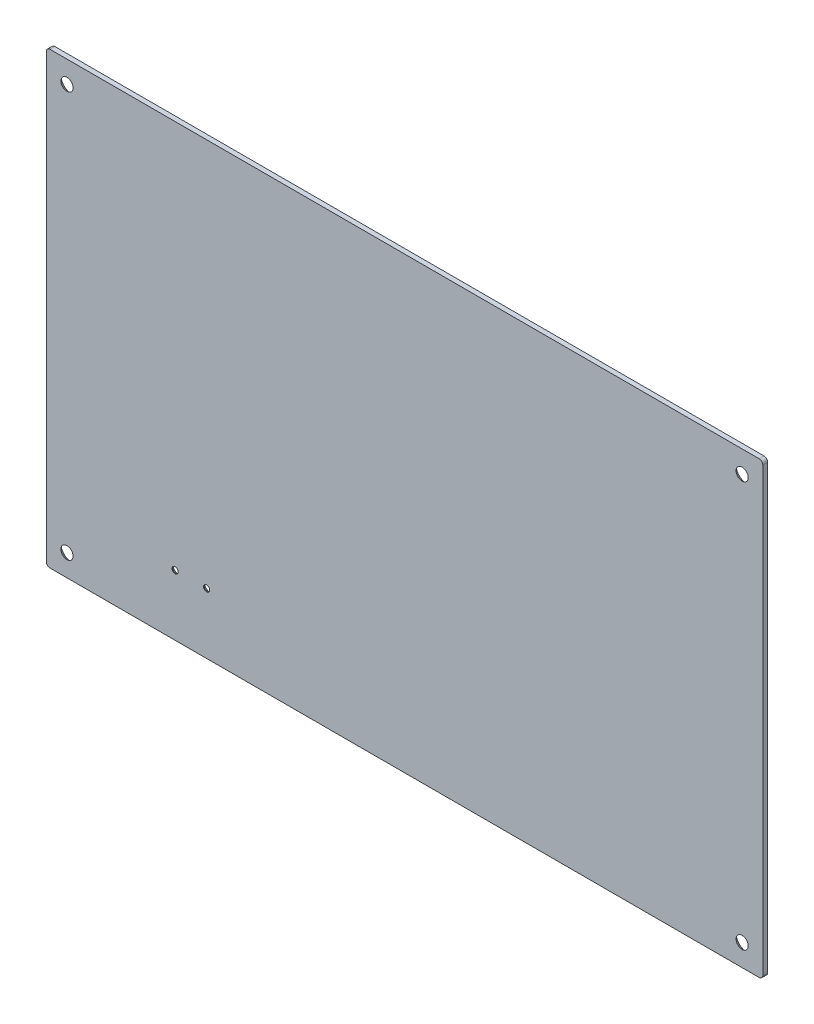
ISO-10303-21;
HEADER;
FILE_DESCRIPTION(('STEP AP214'),'2;1');
FILE_NAME('part.step','',(''),(''),'','','');
FILE_SCHEMA(('AUTOMOTIVE_DESIGN { 1 0 10303 214 1 1 1 1 }'));
ENDSEC;
DATA;
#1=APPLICATION_CONTEXT('core data for automotive mechanical design processes');
#2=APPLICATION_PROTOCOL_DEFINITION('international standard','automotive_design',2000,#1);
#3=PRODUCT_CONTEXT('',#1,'mechanical');
#4=PRODUCT('Part','Part','',(#3));
#5=PRODUCT_RELATED_PRODUCT_CATEGORY('part','',(#4));
#6=PRODUCT_DEFINITION_FORMATION('','',#4);
#7=PRODUCT_DEFINITION_CONTEXT('part definition',#1,'design');
#8=PRODUCT_DEFINITION('design','',#6,#7);
#9=PRODUCT_DEFINITION_SHAPE('','',#8);
#10=(LENGTH_UNIT() NAMED_UNIT(*) SI_UNIT(.MILLI.,.METRE.));
#11=(NAMED_UNIT(*) PLANE_ANGLE_UNIT() SI_UNIT($,.RADIAN.));
#12=(NAMED_UNIT(*) SI_UNIT($,.STERADIAN.) SOLID_ANGLE_UNIT());
#13=UNCERTAINTY_MEASURE_WITH_UNIT(LENGTH_MEASURE(1.E-05),#10,'distance_accuracy_value','');
#14=(GEOMETRIC_REPRESENTATION_CONTEXT(3) GLOBAL_UNCERTAINTY_ASSIGNED_CONTEXT((#13)) GLOBAL_UNIT_ASSIGNED_CONTEXT((#10,
#11,#12)) REPRESENTATION_CONTEXT('',''));
#15=CARTESIAN_POINT('',(0.,0.,0.));
#16=DIRECTION('',(0.,0.,1.));
#17=DIRECTION('',(1.,0.,0.));
#18=AXIS2_PLACEMENT_3D('',#15,#16,#17);
#19=CARTESIAN_POINT('',(146.,-91.,2.));
#20=DIRECTION('',(0.,0.,1.));
#21=DIRECTION('',(1.,0.,0.));
#22=AXIS2_PLACEMENT_3D('',#19,#20,#21);
#23=PLANE('',#22);
#24=CARTESIAN_POINT('',(-94.5000000000001,-67.5,2.));
#25=DIRECTION('',(0.,0.,1.));
#26=DIRECTION('',(1.,0.,0.));
#27=AXIS2_PLACEMENT_3D('',#24,#25,#26);
#28=CIRCLE('',#27,1.24999999999999);
#29=CARTESIAN_POINT('',(-93.2500000000001,-67.5,2.));
#30=VERTEX_POINT('',#29);
#31=EDGE_CURVE('E217',#30,#30,#28,.T.);
#32=ORIENTED_EDGE('',*,*,#31,.F.);
#33=EDGE_LOOP('',(#32));
#34=FACE_BOUND('',#33,.T.);
#35=CARTESIAN_POINT('',(-81.5000000000001,-67.5,2.));
#36=DIRECTION('',(0.,0.,1.));
#37=DIRECTION('',(1.,0.,0.));
#38=AXIS2_PLACEMENT_3D('',#35,#36,#37);
#39=CIRCLE('',#38,1.24999999999999);
#40=CARTESIAN_POINT('',(-80.2500000000001,-67.5,2.));
#41=VERTEX_POINT('',#40);
#42=EDGE_CURVE('E208',#41,#41,#39,.T.);
#43=ORIENTED_EDGE('',*,*,#42,.F.);
#44=EDGE_LOOP('',(#43));
#45=FACE_BOUND('',#44,.T.);
#46=CARTESIAN_POINT('',(139.,-83.5,2.));
#47=DIRECTION('',(0.,0.,1.));
#48=DIRECTION('',(1.,0.,0.));
#49=AXIS2_PLACEMENT_3D('',#46,#47,#48);
#50=CIRCLE('',#49,2.50000000000001);
#51=CARTESIAN_POINT('',(141.5,-83.5,2.));
#52=VERTEX_POINT('',#51);
#53=EDGE_CURVE('E199',#52,#52,#50,.T.);
#54=ORIENTED_EDGE('',*,*,#53,.F.);
#55=EDGE_LOOP('',(#54));
#56=FACE_BOUND('',#55,.T.);
#57=CARTESIAN_POINT('',(-139.,-83.5,2.));
#58=DIRECTION('',(0.,0.,1.));
#59=DIRECTION('',(1.,0.,0.));
#60=AXIS2_PLACEMENT_3D('',#57,#58,#59);
#61=CIRCLE('',#60,2.50000000000001);
#62=CARTESIAN_POINT('',(-136.5,-83.5,2.));
#63=VERTEX_POINT('',#62);
#64=EDGE_CURVE('E187',#63,#63,#61,.T.);
#65=ORIENTED_EDGE('',*,*,#64,.F.);
#66=EDGE_LOOP('',(#65));
#67=FACE_BOUND('',#66,.T.);
#68=CARTESIAN_POINT('',(146.,-91.,2.));
#69=DIRECTION('',(0.,0.,1.));
#70=DIRECTION('',(1.,0.,0.));
#71=AXIS2_PLACEMENT_3D('',#68,#69,#70);
#72=CIRCLE('',#71,1.49999999999999);
#73=CARTESIAN_POINT('',(146.,-92.5,2.));
#74=VERTEX_POINT('',#73);
#75=CARTESIAN_POINT('',(147.5,-91.,2.));
#76=VERTEX_POINT('',#75);
#77=EDGE_CURVE('E149',#74,#76,#72,.T.);
#78=ORIENTED_EDGE('',*,*,#77,.T.);
#79=DIRECTION('',(0.,1.,0.));
#80=VECTOR('',#79,1.);
#81=CARTESIAN_POINT('',(147.5,91.,2.));
#82=LINE('',#81,#80);
#83=CARTESIAN_POINT('',(147.5,91.,2.));
#84=VERTEX_POINT('',#83);
#85=EDGE_CURVE('E97',#76,#84,#82,.T.);
#86=ORIENTED_EDGE('',*,*,#85,.T.);
#87=CARTESIAN_POINT('',(146.,91.,2.));
#88=DIRECTION('',(0.,0.,1.));
#89=DIRECTION('',(-1.,0.,0.));
#90=AXIS2_PLACEMENT_3D('',#87,#88,#89);
#91=CIRCLE('',#90,1.5);
#92=CARTESIAN_POINT('',(146.,92.5,2.));
#93=VERTEX_POINT('',#92);
#94=EDGE_CURVE('E164',#84,#93,#91,.T.);
#95=ORIENTED_EDGE('',*,*,#94,.T.);
#96=DIRECTION('',(-1.,0.,0.));
#97=VECTOR('',#96,1.);
#98=CARTESIAN_POINT('',(-146.,92.5,2.));
#99=LINE('',#98,#97);
#100=CARTESIAN_POINT('',(-146.,92.5,2.));
#101=VERTEX_POINT('',#100);
#102=EDGE_CURVE('E176',#93,#101,#99,.T.);
#103=ORIENTED_EDGE('',*,*,#102,.T.);
#104=CARTESIAN_POINT('',(-146.,91.,2.));
#105=DIRECTION('',(0.,0.,1.));
#106=DIRECTION('',(-1.,0.,0.));
#107=AXIS2_PLACEMENT_3D('',#104,#105,#106);
#108=CIRCLE('',#107,1.5);
#109=CARTESIAN_POINT('',(-147.5,91.,2.));
#110=VERTEX_POINT('',#109);
#111=EDGE_CURVE('E116',#101,#110,#108,.T.);
#112=ORIENTED_EDGE('',*,*,#111,.T.);
#113=DIRECTION('',(0.,-1.,0.));
#114=VECTOR('',#113,1.);
#115=CARTESIAN_POINT('',(-147.5,91.,2.));
#116=LINE('',#115,#114);
#117=CARTESIAN_POINT('',(-147.5,-91.,2.));
#118=VERTEX_POINT('',#117);
#119=EDGE_CURVE('E110',#110,#118,#116,.T.);
#120=ORIENTED_EDGE('',*,*,#119,.T.);
#121=CARTESIAN_POINT('',(-146.,-91.,2.));
#122=DIRECTION('',(0.,0.,1.));
#123=DIRECTION('',(-1.,0.,0.));
#124=AXIS2_PLACEMENT_3D('',#121,#122,#123);
#125=CIRCLE('',#124,1.49999999999999);
#126=CARTESIAN_POINT('',(-146.,-92.5,2.));
#127=VERTEX_POINT('',#126);
#128=EDGE_CURVE('E114',#118,#127,#125,.T.);
#129=ORIENTED_EDGE('',*,*,#128,.T.);
#130=DIRECTION('',(1.,0.,0.));
#131=VECTOR('',#130,1.);
#132=CARTESIAN_POINT('',(-146.,-92.5,2.));
#133=LINE('',#132,#131);
#134=EDGE_CURVE('E54',#127,#74,#133,.T.);
#135=ORIENTED_EDGE('',*,*,#134,.T.);
#136=EDGE_LOOP('',(#78,#86,#95,#103,#112,#120,#129,#135));
#137=FACE_BOUND('',#136,.T.);
#138=CARTESIAN_POINT('',(-139.,83.5,2.));
#139=DIRECTION('',(0.,0.,1.));
#140=DIRECTION('',(1.,0.,0.));
#141=AXIS2_PLACEMENT_3D('',#138,#139,#140);
#142=CIRCLE('',#141,2.50000000000001);
#143=CARTESIAN_POINT('',(-136.5,83.5,2.));
#144=VERTEX_POINT('',#143);
#145=EDGE_CURVE('E138',#144,#144,#142,.T.);
#146=ORIENTED_EDGE('',*,*,#145,.F.);
#147=EDGE_LOOP('',(#146));
#148=FACE_BOUND('',#147,.T.);
#149=CARTESIAN_POINT('',(139.,83.5,2.));
#150=DIRECTION('',(0.,0.,1.));
#151=DIRECTION('',(1.,0.,0.));
#152=AXIS2_PLACEMENT_3D('',#149,#150,#151);
#153=CIRCLE('',#152,2.50000000000001);
#154=CARTESIAN_POINT('',(141.5,83.5,2.));
#155=VERTEX_POINT('',#154);
#156=EDGE_CURVE('E193',#155,#155,#153,.T.);
#157=ORIENTED_EDGE('',*,*,#156,.F.);
#158=EDGE_LOOP('',(#157));
#159=FACE_BOUND('',#158,.T.);
#160=ADVANCED_FACE('F37',(#34,#45,#56,#67,#137,#148,#159),#23,.T.);
#161=CARTESIAN_POINT('',(146.,-91.,2.));
#162=DIRECTION('',(0.,0.,-1.));
#163=DIRECTION('',(-1.,0.,0.));
#164=AXIS2_PLACEMENT_3D('',#161,#162,#163);
#165=CYLINDRICAL_SURFACE('',#164,1.49999999999999);
#166=CARTESIAN_POINT('',(146.,-91.,0.));
#167=DIRECTION('',(0.,0.,1.));
#168=DIRECTION('',(1.,0.,0.));
#169=AXIS2_PLACEMENT_3D('',#166,#167,#168);
#170=CIRCLE('',#169,1.49999999999999);
#171=CARTESIAN_POINT('',(146.,-92.5,0.));
#172=VERTEX_POINT('',#171);
#173=CARTESIAN_POINT('',(147.5,-91.,0.));
#174=VERTEX_POINT('',#173);
#175=EDGE_CURVE('E134',#172,#174,#170,.T.);
#176=ORIENTED_EDGE('',*,*,#175,.T.);
#177=DIRECTION('',(0.,0.,-1.));
#178=VECTOR('',#177,1.);
#179=CARTESIAN_POINT('',(147.5,-91.,2.));
#180=LINE('',#179,#178);
#181=EDGE_CURVE('E11',#76,#174,#180,.T.);
#182=ORIENTED_EDGE('',*,*,#181,.F.);
#183=ORIENTED_EDGE('',*,*,#77,.F.);
#184=DIRECTION('',(0.,0.,-1.));
#185=VECTOR('',#184,1.);
#186=CARTESIAN_POINT('',(146.,-92.5,2.));
#187=LINE('',#186,#185);
#188=EDGE_CURVE('E130',#74,#172,#187,.T.);
#189=ORIENTED_EDGE('',*,*,#188,.T.);
#190=EDGE_LOOP('',(#176,#182,#183,#189));
#191=FACE_BOUND('',#190,.T.);
#192=ADVANCED_FACE('F39',(#191),#165,.T.);
#193=CARTESIAN_POINT('',(147.5,91.,2.));
#194=DIRECTION('',(-1.,0.,0.));
#195=DIRECTION('',(0.,0.,1.));
#196=AXIS2_PLACEMENT_3D('',#193,#194,#195);
#197=PLANE('',#196);
#198=DIRECTION('',(0.,1.,0.));
#199=VECTOR('',#198,1.);
#200=CARTESIAN_POINT('',(147.5,91.,0.));
#201=LINE('',#200,#199);
#202=CARTESIAN_POINT('',(147.5,91.,0.));
#203=VERTEX_POINT('',#202);
#204=EDGE_CURVE('E137',#174,#203,#201,.T.);
#205=ORIENTED_EDGE('',*,*,#204,.T.);
#206=DIRECTION('',(0.,0.,-1.));
#207=VECTOR('',#206,1.);
#208=CARTESIAN_POINT('',(147.5,91.,2.));
#209=LINE('',#208,#207);
#210=EDGE_CURVE('E46',#84,#203,#209,.T.);
#211=ORIENTED_EDGE('',*,*,#210,.F.);
#212=ORIENTED_EDGE('',*,*,#85,.F.);
#213=ORIENTED_EDGE('',*,*,#181,.T.);
#214=EDGE_LOOP('',(#205,#211,#212,#213));
#215=FACE_BOUND('',#214,.T.);
#216=ADVANCED_FACE('F280',(#215),#197,.F.);
#217=CARTESIAN_POINT('',(146.,91.,2.));
#218=DIRECTION('',(0.,0.,-1.));
#219=DIRECTION('',(-1.,0.,0.));
#220=AXIS2_PLACEMENT_3D('',#217,#218,#219);
#221=CYLINDRICAL_SURFACE('',#220,1.5);
#222=CARTESIAN_POINT('',(146.,91.,0.));
#223=DIRECTION('',(0.,0.,1.));
#224=DIRECTION('',(-1.,0.,0.));
#225=AXIS2_PLACEMENT_3D('',#222,#223,#224);
#226=CIRCLE('',#225,1.5);
#227=CARTESIAN_POINT('',(146.,92.5,0.));
#228=VERTEX_POINT('',#227);
#229=EDGE_CURVE('E140',#203,#228,#226,.T.);
#230=ORIENTED_EDGE('',*,*,#229,.T.);
#231=DIRECTION('',(0.,0.,-1.));
#232=VECTOR('',#231,1.);
#233=CARTESIAN_POINT('',(146.,92.5,2.));
#234=LINE('',#233,#232);
#235=EDGE_CURVE('E156',#93,#228,#234,.T.);
#236=ORIENTED_EDGE('',*,*,#235,.F.);
#237=ORIENTED_EDGE('',*,*,#94,.F.);
#238=ORIENTED_EDGE('',*,*,#210,.T.);
#239=EDGE_LOOP('',(#230,#236,#237,#238));
#240=FACE_BOUND('',#239,.T.);
#241=ADVANCED_FACE('F162',(#240),#221,.T.);
#242=CARTESIAN_POINT('',(-146.,92.5,2.));
#243=DIRECTION('',(0.,-1.,0.));
#244=DIRECTION('',(0.,0.,-1.));
#245=AXIS2_PLACEMENT_3D('',#242,#243,#244);
#246=PLANE('',#245);
#247=DIRECTION('',(-1.,0.,0.));
#248=VECTOR('',#247,1.);
#249=CARTESIAN_POINT('',(-146.,92.5,0.));
#250=LINE('',#249,#248);
#251=CARTESIAN_POINT('',(-146.,92.5,0.));
#252=VERTEX_POINT('',#251);
#253=EDGE_CURVE('E142',#228,#252,#250,.T.);
#254=ORIENTED_EDGE('',*,*,#253,.T.);
#255=DIRECTION('',(0.,0.,-1.));
#256=VECTOR('',#255,1.);
#257=CARTESIAN_POINT('',(-146.,92.5,2.));
#258=LINE('',#257,#256);
#259=EDGE_CURVE('E153',#101,#252,#258,.T.);
#260=ORIENTED_EDGE('',*,*,#259,.F.);
#261=ORIENTED_EDGE('',*,*,#102,.F.);
#262=ORIENTED_EDGE('',*,*,#235,.T.);
#263=EDGE_LOOP('',(#254,#260,#261,#262));
#264=FACE_BOUND('',#263,.T.);
#265=ADVANCED_FACE('F172',(#264),#246,.F.);
#266=CARTESIAN_POINT('',(-146.,91.,2.));
#267=DIRECTION('',(0.,0.,-1.));
#268=DIRECTION('',(-1.,0.,0.));
#269=AXIS2_PLACEMENT_3D('',#266,#267,#268);
#270=CYLINDRICAL_SURFACE('',#269,1.5);
#271=CARTESIAN_POINT('',(-146.,91.,0.));
#272=DIRECTION('',(0.,0.,1.));
#273=DIRECTION('',(-1.,0.,0.));
#274=AXIS2_PLACEMENT_3D('',#271,#272,#273);
#275=CIRCLE('',#274,1.5);
#276=CARTESIAN_POINT('',(-147.5,91.,0.));
#277=VERTEX_POINT('',#276);
#278=EDGE_CURVE('E144',#252,#277,#275,.T.);
#279=ORIENTED_EDGE('',*,*,#278,.T.);
#280=DIRECTION('',(0.,0.,-1.));
#281=VECTOR('',#280,1.);
#282=CARTESIAN_POINT('',(-147.5,91.,2.));
#283=LINE('',#282,#281);
#284=EDGE_CURVE('E125',#110,#277,#283,.T.);
#285=ORIENTED_EDGE('',*,*,#284,.F.);
#286=ORIENTED_EDGE('',*,*,#111,.F.);
#287=ORIENTED_EDGE('',*,*,#259,.T.);
#288=EDGE_LOOP('',(#279,#285,#286,#287));
#289=FACE_BOUND('',#288,.T.);
#290=ADVANCED_FACE('F175',(#289),#270,.T.);
#291=CARTESIAN_POINT('',(-147.5,91.,2.));
#292=DIRECTION('',(1.,0.,0.));
#293=DIRECTION('',(0.,1.,0.));
#294=AXIS2_PLACEMENT_3D('',#291,#292,#293);
#295=PLANE('',#294);
#296=DIRECTION('',(0.,-1.,0.));
#297=VECTOR('',#296,1.);
#298=CARTESIAN_POINT('',(-147.5,91.,0.));
#299=LINE('',#298,#297);
#300=CARTESIAN_POINT('',(-147.5,-91.,0.));
#301=VERTEX_POINT('',#300);
#302=EDGE_CURVE('E124',#277,#301,#299,.T.);
#303=ORIENTED_EDGE('',*,*,#302,.T.);
#304=DIRECTION('',(0.,0.,-1.));
#305=VECTOR('',#304,1.);
#306=CARTESIAN_POINT('',(-147.5,-91.,2.));
#307=LINE('',#306,#305);
#308=EDGE_CURVE('E121',#118,#301,#307,.T.);
#309=ORIENTED_EDGE('',*,*,#308,.F.);
#310=ORIENTED_EDGE('',*,*,#119,.F.);
#311=ORIENTED_EDGE('',*,*,#284,.T.);
#312=EDGE_LOOP('',(#303,#309,#310,#311));
#313=FACE_BOUND('',#312,.T.);
#314=ADVANCED_FACE('F122',(#313),#295,.F.);
#315=CARTESIAN_POINT('',(-146.,-91.,2.));
#316=DIRECTION('',(0.,0.,-1.));
#317=DIRECTION('',(-1.,0.,0.));
#318=AXIS2_PLACEMENT_3D('',#315,#316,#317);
#319=CYLINDRICAL_SURFACE('',#318,1.49999999999999);
#320=CARTESIAN_POINT('',(-146.,-91.,0.));
#321=DIRECTION('',(0.,0.,1.));
#322=DIRECTION('',(-1.,0.,0.));
#323=AXIS2_PLACEMENT_3D('',#320,#321,#322);
#324=CIRCLE('',#323,1.49999999999999);
#325=CARTESIAN_POINT('',(-146.,-92.5,0.));
#326=VERTEX_POINT('',#325);
#327=EDGE_CURVE('E83',#301,#326,#324,.T.);
#328=ORIENTED_EDGE('',*,*,#327,.T.);
#329=DIRECTION('',(0.,0.,-1.));
#330=VECTOR('',#329,1.);
#331=CARTESIAN_POINT('',(-146.,-92.5,2.));
#332=LINE('',#331,#330);
#333=EDGE_CURVE('E126',#127,#326,#332,.T.);
#334=ORIENTED_EDGE('',*,*,#333,.F.);
#335=ORIENTED_EDGE('',*,*,#128,.F.);
#336=ORIENTED_EDGE('',*,*,#308,.T.);
#337=EDGE_LOOP('',(#328,#334,#335,#336));
#338=FACE_BOUND('',#337,.T.);
#339=ADVANCED_FACE('F128',(#338),#319,.T.);
#340=CARTESIAN_POINT('',(-146.,-92.5,2.));
#341=DIRECTION('',(0.,1.,0.));
#342=DIRECTION('',(0.,0.,1.));
#343=AXIS2_PLACEMENT_3D('',#340,#341,#342);
#344=PLANE('',#343);
#345=DIRECTION('',(1.,0.,0.));
#346=VECTOR('',#345,1.);
#347=CARTESIAN_POINT('',(-146.,-92.5,0.));
#348=LINE('',#347,#346);
#349=EDGE_CURVE('E89',#326,#172,#348,.T.);
#350=ORIENTED_EDGE('',*,*,#349,.T.);
#351=ORIENTED_EDGE('',*,*,#188,.F.);
#352=ORIENTED_EDGE('',*,*,#134,.F.);
#353=ORIENTED_EDGE('',*,*,#333,.T.);
#354=EDGE_LOOP('',(#350,#351,#352,#353));
#355=FACE_BOUND('',#354,.T.);
#356=ADVANCED_FACE('F258',(#355),#344,.F.);
#357=CARTESIAN_POINT('',(146.,-91.,0.));
#358=DIRECTION('',(0.,0.,1.));
#359=DIRECTION('',(1.,0.,0.));
#360=AXIS2_PLACEMENT_3D('',#357,#358,#359);
#361=PLANE('',#360);
#362=CARTESIAN_POINT('',(-94.5000000000001,-67.5,0.));
#363=DIRECTION('',(0.,0.,1.));
#364=DIRECTION('',(1.,0.,0.));
#365=AXIS2_PLACEMENT_3D('',#362,#363,#364);
#366=CIRCLE('',#365,3.);
#367=CARTESIAN_POINT('',(-91.5000000000001,-67.5,0.));
#368=VERTEX_POINT('',#367);
#369=EDGE_CURVE('E220',#368,#368,#366,.T.);
#370=ORIENTED_EDGE('',*,*,#369,.T.);
#371=EDGE_LOOP('',(#370));
#372=FACE_BOUND('',#371,.T.);
#373=CARTESIAN_POINT('',(-81.5000000000001,-67.5,0.));
#374=DIRECTION('',(0.,0.,1.));
#375=DIRECTION('',(1.,0.,0.));
#376=AXIS2_PLACEMENT_3D('',#373,#374,#375);
#377=CIRCLE('',#376,3.);
#378=CARTESIAN_POINT('',(-78.5000000000001,-67.5,0.));
#379=VERTEX_POINT('',#378);
#380=EDGE_CURVE('E211',#379,#379,#377,.T.);
#381=ORIENTED_EDGE('',*,*,#380,.T.);
#382=EDGE_LOOP('',(#381));
#383=FACE_BOUND('',#382,.T.);
#384=CARTESIAN_POINT('',(139.,-83.5,0.));
#385=DIRECTION('',(0.,0.,1.));
#386=DIRECTION('',(1.,0.,0.));
#387=AXIS2_PLACEMENT_3D('',#384,#385,#386);
#388=CIRCLE('',#387,4.5);
#389=CARTESIAN_POINT('',(143.5,-83.5,0.));
#390=VERTEX_POINT('',#389);
#391=EDGE_CURVE('E202',#390,#390,#388,.T.);
#392=ORIENTED_EDGE('',*,*,#391,.T.);
#393=EDGE_LOOP('',(#392));
#394=FACE_BOUND('',#393,.T.);
#395=CARTESIAN_POINT('',(139.,83.5,0.));
#396=DIRECTION('',(0.,0.,1.));
#397=DIRECTION('',(1.,0.,0.));
#398=AXIS2_PLACEMENT_3D('',#395,#396,#397);
#399=CIRCLE('',#398,4.5);
#400=CARTESIAN_POINT('',(143.5,83.5,0.));
#401=VERTEX_POINT('',#400);
#402=EDGE_CURVE('E196',#401,#401,#399,.T.);
#403=ORIENTED_EDGE('',*,*,#402,.T.);
#404=EDGE_LOOP('',(#403));
#405=FACE_BOUND('',#404,.T.);
#406=CARTESIAN_POINT('',(-139.,-83.5,0.));
#407=DIRECTION('',(0.,0.,1.));
#408=DIRECTION('',(1.,0.,0.));
#409=AXIS2_PLACEMENT_3D('',#406,#407,#408);
#410=CIRCLE('',#409,4.5);
#411=CARTESIAN_POINT('',(-134.5,-83.5,0.));
#412=VERTEX_POINT('',#411);
#413=EDGE_CURVE('E190',#412,#412,#410,.T.);
#414=ORIENTED_EDGE('',*,*,#413,.T.);
#415=EDGE_LOOP('',(#414));
#416=FACE_BOUND('',#415,.T.);
#417=CARTESIAN_POINT('',(-139.,83.5,0.));
#418=DIRECTION('',(0.,0.,1.));
#419=DIRECTION('',(1.,0.,0.));
#420=AXIS2_PLACEMENT_3D('',#417,#418,#419);
#421=CIRCLE('',#420,4.5);
#422=CARTESIAN_POINT('',(-134.5,83.5,0.));
#423=VERTEX_POINT('',#422);
#424=EDGE_CURVE('E184',#423,#423,#421,.T.);
#425=ORIENTED_EDGE('',*,*,#424,.T.);
#426=EDGE_LOOP('',(#425));
#427=FACE_BOUND('',#426,.T.);
#428=ORIENTED_EDGE('',*,*,#175,.F.);
#429=ORIENTED_EDGE('',*,*,#349,.F.);
#430=ORIENTED_EDGE('',*,*,#327,.F.);
#431=ORIENTED_EDGE('',*,*,#302,.F.);
#432=ORIENTED_EDGE('',*,*,#278,.F.);
#433=ORIENTED_EDGE('',*,*,#253,.F.);
#434=ORIENTED_EDGE('',*,*,#229,.F.);
#435=ORIENTED_EDGE('',*,*,#204,.F.);
#436=EDGE_LOOP('',(#428,#429,#430,#431,#432,#433,#434,#435));
#437=FACE_BOUND('',#436,.T.);
#438=ADVANCED_FACE('F168',(#372,#383,#394,#405,#416,#427,#437),#361,.F.);
#439=CARTESIAN_POINT('',(-139.,83.5,2.85000000000001));
#440=DIRECTION('',(0.,0.,-1.));
#441=DIRECTION('',(-1.,0.,0.));
#442=AXIS2_PLACEMENT_3D('',#439,#440,#441);
#443=CONICAL_SURFACE('',#442,1.65000000000001,0.785398163397446);
#444=ORIENTED_EDGE('',*,*,#145,.T.);
#445=EDGE_LOOP('',(#444));
#446=FACE_BOUND('',#445,.T.);
#447=ORIENTED_EDGE('',*,*,#424,.F.);
#448=EDGE_LOOP('',(#447));
#449=FACE_BOUND('',#448,.T.);
#450=ADVANCED_FACE('F252',(#446,#449),#443,.F.);
#451=CARTESIAN_POINT('',(-139.,-83.5,2.85000000000001));
#452=DIRECTION('',(0.,0.,-1.));
#453=DIRECTION('',(-1.,0.,0.));
#454=AXIS2_PLACEMENT_3D('',#451,#452,#453);
#455=CONICAL_SURFACE('',#454,1.65000000000001,0.785398163397446);
#456=ORIENTED_EDGE('',*,*,#64,.T.);
#457=EDGE_LOOP('',(#456));
#458=FACE_BOUND('',#457,.T.);
#459=ORIENTED_EDGE('',*,*,#413,.F.);
#460=EDGE_LOOP('',(#459));
#461=FACE_BOUND('',#460,.T.);
#462=ADVANCED_FACE('F248',(#458,#461),#455,.F.);
#463=CARTESIAN_POINT('',(139.,83.5,2.85000000000001));
#464=DIRECTION('',(0.,0.,-1.));
#465=DIRECTION('',(-1.,0.,0.));
#466=AXIS2_PLACEMENT_3D('',#463,#464,#465);
#467=CONICAL_SURFACE('',#466,1.65000000000001,0.785398163397446);
#468=ORIENTED_EDGE('',*,*,#156,.T.);
#469=EDGE_LOOP('',(#468));
#470=FACE_BOUND('',#469,.T.);
#471=ORIENTED_EDGE('',*,*,#402,.F.);
#472=EDGE_LOOP('',(#471));
#473=FACE_BOUND('',#472,.T.);
#474=ADVANCED_FACE('F251',(#470,#473),#467,.F.);
#475=CARTESIAN_POINT('',(139.,-83.5,2.85000000000001));
#476=DIRECTION('',(0.,0.,-1.));
#477=DIRECTION('',(-1.,0.,0.));
#478=AXIS2_PLACEMENT_3D('',#475,#476,#477);
#479=CONICAL_SURFACE('',#478,1.65000000000001,0.785398163397446);
#480=ORIENTED_EDGE('',*,*,#53,.T.);
#481=EDGE_LOOP('',(#480));
#482=FACE_BOUND('',#481,.T.);
#483=ORIENTED_EDGE('',*,*,#391,.F.);
#484=EDGE_LOOP('',(#483));
#485=FACE_BOUND('',#484,.T.);
#486=ADVANCED_FACE('F303',(#482,#485),#479,.F.);
#487=CARTESIAN_POINT('',(-81.5000000000001,-67.5,1.75));
#488=DIRECTION('',(0.,0.,-1.));
#489=DIRECTION('',(-1.,0.,0.));
#490=AXIS2_PLACEMENT_3D('',#487,#488,#489);
#491=CONICAL_SURFACE('',#490,1.25,0.785398163397448);
#492=ORIENTED_EDGE('',*,*,#380,.F.);
#493=EDGE_LOOP('',(#492));
#494=FACE_BOUND('',#493,.T.);
#495=CARTESIAN_POINT('',(-81.5000000000001,-67.5,1.75));
#496=DIRECTION('',(0.,0.,1.));
#497=DIRECTION('',(1.,0.,0.));
#498=AXIS2_PLACEMENT_3D('',#495,#496,#497);
#499=CIRCLE('',#498,1.25);
#500=CARTESIAN_POINT('',(-80.2500000000001,-67.5,1.75));
#501=VERTEX_POINT('',#500);
#502=EDGE_CURVE('E205',#501,#501,#499,.T.);
#503=ORIENTED_EDGE('',*,*,#502,.T.);
#504=EDGE_LOOP('',(#503));
#505=FACE_BOUND('',#504,.T.);
#506=ADVANCED_FACE('F316',(#494,#505),#491,.F.);
#507=CARTESIAN_POINT('',(-81.5000000000001,-67.5,2.));
#508=DIRECTION('',(0.,0.,1.));
#509=DIRECTION('',(1.,0.,0.));
#510=AXIS2_PLACEMENT_3D('',#507,#508,#509);
#511=CYLINDRICAL_SURFACE('',#510,1.24999999999999);
#512=ORIENTED_EDGE('',*,*,#502,.F.);
#513=EDGE_LOOP('',(#512));
#514=FACE_BOUND('',#513,.T.);
#515=ORIENTED_EDGE('',*,*,#42,.T.);
#516=EDGE_LOOP('',(#515));
#517=FACE_BOUND('',#516,.T.);
#518=ADVANCED_FACE('F230',(#514,#517),#511,.F.);
#519=CARTESIAN_POINT('',(-94.5000000000001,-67.5,1.75));
#520=DIRECTION('',(0.,0.,-1.));
#521=DIRECTION('',(-1.,0.,0.));
#522=AXIS2_PLACEMENT_3D('',#519,#520,#521);
#523=CONICAL_SURFACE('',#522,1.25,0.785398163397448);
#524=ORIENTED_EDGE('',*,*,#369,.F.);
#525=EDGE_LOOP('',(#524));
#526=FACE_BOUND('',#525,.T.);
#527=CARTESIAN_POINT('',(-94.5000000000001,-67.5,1.75));
#528=DIRECTION('',(0.,0.,1.));
#529=DIRECTION('',(1.,0.,0.));
#530=AXIS2_PLACEMENT_3D('',#527,#528,#529);
#531=CIRCLE('',#530,1.25);
#532=CARTESIAN_POINT('',(-93.2500000000001,-67.5,1.75));
#533=VERTEX_POINT('',#532);
#534=EDGE_CURVE('E214',#533,#533,#531,.T.);
#535=ORIENTED_EDGE('',*,*,#534,.T.);
#536=EDGE_LOOP('',(#535));
#537=FACE_BOUND('',#536,.T.);
#538=ADVANCED_FACE('F226',(#526,#537),#523,.F.);
#539=CARTESIAN_POINT('',(-94.5000000000001,-67.5,2.));
#540=DIRECTION('',(0.,0.,1.));
#541=DIRECTION('',(1.,0.,0.));
#542=AXIS2_PLACEMENT_3D('',#539,#540,#541);
#543=CYLINDRICAL_SURFACE('',#542,1.24999999999999);
#544=ORIENTED_EDGE('',*,*,#534,.F.);
#545=EDGE_LOOP('',(#544));
#546=FACE_BOUND('',#545,.T.);
#547=ORIENTED_EDGE('',*,*,#31,.T.);
#548=EDGE_LOOP('',(#547));
#549=FACE_BOUND('',#548,.T.);
#550=ADVANCED_FACE('F229',(#546,#549),#543,.F.);
#551=CLOSED_SHELL('',(#160,#192,#216,#241,#265,#290,#314,#339,#356,#438,#450,#462,#474,#486,
#506,#518,#538,#550));
#552=MANIFOLD_SOLID_BREP('B2',#551);
#553=ADVANCED_BREP_SHAPE_REPRESENTATION('',(#18,#552),#14);
#554=SHAPE_DEFINITION_REPRESENTATION(#9,#553);
ENDSEC;
END-ISO-10303-21;
